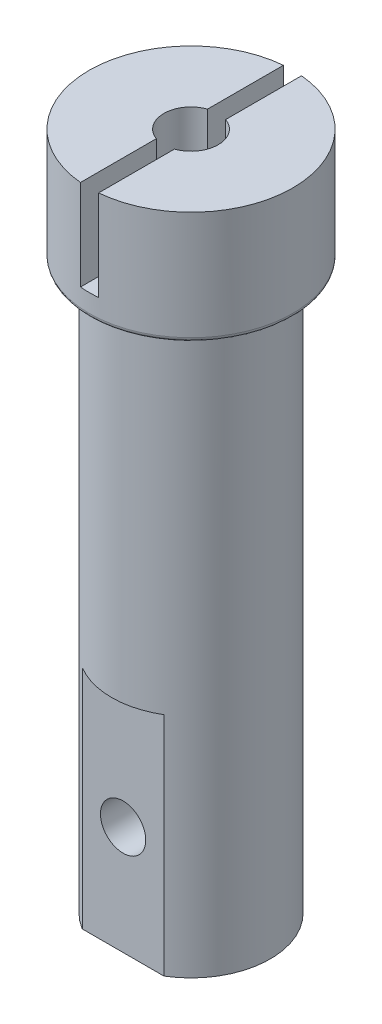
ISO-10303-21;
HEADER;
FILE_DESCRIPTION(('STEP AP214'),'2;1');
FILE_NAME('part.step','',(''),(''),'','','');
FILE_SCHEMA(('AUTOMOTIVE_DESIGN { 1 0 10303 214 1 1 1 1 }'));
ENDSEC;
DATA;
#1=APPLICATION_CONTEXT('core data for automotive mechanical design processes');
#2=APPLICATION_PROTOCOL_DEFINITION('international standard','automotive_design',2000,#1);
#3=PRODUCT_CONTEXT('',#1,'mechanical');
#4=PRODUCT('Part','Part','',(#3));
#5=PRODUCT_RELATED_PRODUCT_CATEGORY('part','',(#4));
#6=PRODUCT_DEFINITION_FORMATION('','',#4);
#7=PRODUCT_DEFINITION_CONTEXT('part definition',#1,'design');
#8=PRODUCT_DEFINITION('design','',#6,#7);
#9=PRODUCT_DEFINITION_SHAPE('','',#8);
#10=(LENGTH_UNIT() NAMED_UNIT(*) SI_UNIT(.MILLI.,.METRE.));
#11=(NAMED_UNIT(*) PLANE_ANGLE_UNIT() SI_UNIT($,.RADIAN.));
#12=(NAMED_UNIT(*) SI_UNIT($,.STERADIAN.) SOLID_ANGLE_UNIT());
#13=UNCERTAINTY_MEASURE_WITH_UNIT(LENGTH_MEASURE(1.E-05),#10,'distance_accuracy_value','');
#14=(GEOMETRIC_REPRESENTATION_CONTEXT(3) GLOBAL_UNCERTAINTY_ASSIGNED_CONTEXT((#13)) GLOBAL_UNIT_ASSIGNED_CONTEXT((#10,
#11,#12)) REPRESENTATION_CONTEXT('',''));
#15=CARTESIAN_POINT('',(0.,0.,0.));
#16=DIRECTION('',(0.,0.,1.));
#17=DIRECTION('',(1.,0.,0.));
#18=AXIS2_PLACEMENT_3D('',#15,#16,#17);
#19=CARTESIAN_POINT('',(0.,-150.,0.));
#20=DIRECTION('',(0.,1.,0.));
#21=DIRECTION('',(0.,0.,1.));
#22=AXIS2_PLACEMENT_3D('',#19,#20,#21);
#23=CYLINDRICAL_SURFACE('',#22,17.5);
#24=CARTESIAN_POINT('',(0.,-25.,0.));
#25=DIRECTION('',(0.,1.,0.));
#26=DIRECTION('',(0.,0.,1.));
#27=AXIS2_PLACEMENT_3D('',#24,#25,#26);
#28=CIRCLE('',#27,17.5);
#29=CARTESIAN_POINT('',(0.,-25.,17.5));
#30=VERTEX_POINT('',#29);
#31=EDGE_CURVE('E133',#30,#30,#28,.T.);
#32=ORIENTED_EDGE('',*,*,#31,.F.);
#33=EDGE_LOOP('',(#32));
#34=FACE_BOUND('',#33,.T.);
#35=CARTESIAN_POINT('',(0.,-100.,0.));
#36=DIRECTION('',(0.,1.,0.));
#37=DIRECTION('',(0.,0.,1.));
#38=AXIS2_PLACEMENT_3D('',#35,#36,#37);
#39=CIRCLE('',#38,17.5);
#40=CARTESIAN_POINT('',(9.01387818865998,-100.,15.));
#41=VERTEX_POINT('',#40);
#42=CARTESIAN_POINT('',(-9.01387818865998,-100.,15.));
#43=VERTEX_POINT('',#42);
#44=EDGE_CURVE('E123',#41,#43,#39,.F.);
#45=ORIENTED_EDGE('',*,*,#44,.F.);
#46=DIRECTION('',(0.,1.,0.));
#47=VECTOR('',#46,1.);
#48=CARTESIAN_POINT('',(9.01387818865998,-150.,15.));
#49=LINE('',#48,#47);
#50=CARTESIAN_POINT('',(9.01387818865998,-150.,15.));
#51=VERTEX_POINT('',#50);
#52=EDGE_CURVE('E118',#41,#51,#49,.F.);
#53=ORIENTED_EDGE('',*,*,#52,.T.);
#54=CARTESIAN_POINT('',(0.,-150.,0.));
#55=DIRECTION('',(0.,1.,0.));
#56=DIRECTION('',(0.,0.,1.));
#57=AXIS2_PLACEMENT_3D('',#54,#55,#56);
#58=CIRCLE('',#57,17.5);
#59=CARTESIAN_POINT('',(-9.01387818865998,-150.,15.));
#60=VERTEX_POINT('',#59);
#61=EDGE_CURVE('E128',#51,#60,#58,.T.);
#62=ORIENTED_EDGE('',*,*,#61,.T.);
#63=DIRECTION('',(0.,1.,0.));
#64=VECTOR('',#63,1.);
#65=CARTESIAN_POINT('',(-9.01387818865998,-150.,15.));
#66=LINE('',#65,#64);
#67=EDGE_CURVE('E54',#60,#43,#66,.T.);
#68=ORIENTED_EDGE('',*,*,#67,.T.);
#69=EDGE_LOOP('',(#45,#53,#62,#68));
#70=FACE_BOUND('',#69,.T.);
#71=ADVANCED_FACE('F39',(#34,#70),#23,.T.);
#72=CARTESIAN_POINT('',(0.,-150.,0.));
#73=DIRECTION('',(0.,1.,0.));
#74=DIRECTION('',(0.,0.,1.));
#75=AXIS2_PLACEMENT_3D('',#72,#73,#74);
#76=PLANE('',#75);
#77=CARTESIAN_POINT('',(0.,-150.,0.));
#78=DIRECTION('',(0.,1.,0.));
#79=DIRECTION('',(0.,0.,1.));
#80=AXIS2_PLACEMENT_3D('',#77,#78,#79);
#81=CIRCLE('',#80,6.);
#82=CARTESIAN_POINT('',(0.,-150.,6.));
#83=VERTEX_POINT('',#82);
#84=EDGE_CURVE('E139',#83,#83,#81,.T.);
#85=ORIENTED_EDGE('',*,*,#84,.T.);
#86=EDGE_LOOP('',(#85));
#87=FACE_BOUND('',#86,.T.);
#88=DIRECTION('',(1.,0.,0.));
#89=VECTOR('',#88,1.);
#90=CARTESIAN_POINT('',(0.,-150.,15.));
#91=LINE('',#90,#89);
#92=EDGE_CURVE('E115',#60,#51,#91,.T.);
#93=ORIENTED_EDGE('',*,*,#92,.F.);
#94=ORIENTED_EDGE('',*,*,#61,.F.);
#95=EDGE_LOOP('',(#93,#94));
#96=FACE_BOUND('',#95,.T.);
#97=ADVANCED_FACE('F131',(#87,#96),#76,.F.);
#98=CARTESIAN_POINT('',(0.,-150.,0.));
#99=DIRECTION('',(0.,1.,0.));
#100=DIRECTION('',(0.,0.,1.));
#101=AXIS2_PLACEMENT_3D('',#98,#99,#100);
#102=CYLINDRICAL_SURFACE('',#101,22.5);
#103=CARTESIAN_POINT('',(0.,-24.,0.));
#104=DIRECTION('',(0.,1.,0.));
#105=DIRECTION('',(0.,0.,1.));
#106=AXIS2_PLACEMENT_3D('',#103,#104,#105);
#107=CIRCLE('',#106,22.5);
#108=CARTESIAN_POINT('',(0.,-24.,22.5));
#109=VERTEX_POINT('',#108);
#110=EDGE_CURVE('E12',#109,#109,#107,.T.);
#111=ORIENTED_EDGE('',*,*,#110,.T.);
#112=EDGE_LOOP('',(#111));
#113=FACE_BOUND('',#112,.T.);
#114=CARTESIAN_POINT('',(0.,0.,0.));
#115=DIRECTION('',(0.,1.,0.));
#116=DIRECTION('',(0.,0.,1.));
#117=AXIS2_PLACEMENT_3D('',#114,#115,#116);
#118=CIRCLE('',#117,22.5);
#119=CARTESIAN_POINT('',(1.99999999999999,0.,22.410934831015));
#120=VERTEX_POINT('',#119);
#121=CARTESIAN_POINT('',(1.99999999999999,0.,-22.410934831015));
#122=VERTEX_POINT('',#121);
#123=EDGE_CURVE('E136',#120,#122,#118,.T.);
#124=ORIENTED_EDGE('',*,*,#123,.F.);
#125=DIRECTION('',(0.,1.,0.));
#126=VECTOR('',#125,1.);
#127=CARTESIAN_POINT('',(2.00000000000006,-150.,22.410934831015));
#128=LINE('',#127,#126);
#129=CARTESIAN_POINT('',(2.,-20.,22.410934831015));
#130=VERTEX_POINT('',#129);
#131=EDGE_CURVE('E205',#120,#130,#128,.F.);
#132=ORIENTED_EDGE('',*,*,#131,.T.);
#133=CARTESIAN_POINT('',(0.,-20.,0.));
#134=DIRECTION('',(0.,1.,0.));
#135=DIRECTION('',(-1.,0.,0.));
#136=AXIS2_PLACEMENT_3D('',#133,#134,#135);
#137=CIRCLE('',#136,22.5);
#138=CARTESIAN_POINT('',(-2.,-20.,22.4109348310149));
#139=VERTEX_POINT('',#138);
#140=EDGE_CURVE('E232',#130,#139,#137,.F.);
#141=ORIENTED_EDGE('',*,*,#140,.T.);
#142=DIRECTION('',(0.,1.,0.));
#143=VECTOR('',#142,1.);
#144=CARTESIAN_POINT('',(-2.00000000000002,-150.,22.410934831015));
#145=LINE('',#144,#143);
#146=CARTESIAN_POINT('',(-1.99999999999999,0.,22.410934831015));
#147=VERTEX_POINT('',#146);
#148=EDGE_CURVE('E230',#147,#139,#145,.F.);
#149=ORIENTED_EDGE('',*,*,#148,.F.);
#150=CARTESIAN_POINT('',(-1.99999999999999,0.,-22.410934831015));
#151=VERTEX_POINT('',#150);
#152=EDGE_CURVE('E132',#151,#147,#118,.T.);
#153=ORIENTED_EDGE('',*,*,#152,.F.);
#154=DIRECTION('',(0.,1.,0.));
#155=VECTOR('',#154,1.);
#156=CARTESIAN_POINT('',(-2.00000000000002,-150.,-22.410934831015));
#157=LINE('',#156,#155);
#158=CARTESIAN_POINT('',(-2.,-20.,-22.410934831015));
#159=VERTEX_POINT('',#158);
#160=EDGE_CURVE('E218',#159,#151,#157,.T.);
#161=ORIENTED_EDGE('',*,*,#160,.F.);
#162=CARTESIAN_POINT('',(2.,-20.,-22.410934831015));
#163=VERTEX_POINT('',#162);
#164=EDGE_CURVE('E233',#159,#163,#137,.F.);
#165=ORIENTED_EDGE('',*,*,#164,.T.);
#166=DIRECTION('',(0.,1.,0.));
#167=VECTOR('',#166,1.);
#168=CARTESIAN_POINT('',(2.00000000000006,-150.,-22.410934831015));
#169=LINE('',#168,#167);
#170=EDGE_CURVE('E207',#163,#122,#169,.T.);
#171=ORIENTED_EDGE('',*,*,#170,.T.);
#172=EDGE_LOOP('',(#124,#132,#141,#149,#153,#161,#165,#171));
#173=FACE_BOUND('',#172,.T.);
#174=ADVANCED_FACE('F179',(#113,#173),#102,.T.);
#175=CARTESIAN_POINT('',(0.,0.,0.));
#176=DIRECTION('',(0.,1.,0.));
#177=DIRECTION('',(0.,0.,1.));
#178=AXIS2_PLACEMENT_3D('',#175,#176,#177);
#179=PLANE('',#178);
#180=ORIENTED_EDGE('',*,*,#123,.T.);
#181=DIRECTION('',(0.,0.,1.));
#182=VECTOR('',#181,1.);
#183=CARTESIAN_POINT('',(1.99999999999999,0.,-22.5));
#184=LINE('',#183,#182);
#185=CARTESIAN_POINT('',(1.99999999999999,0.,-5.65685424949237));
#186=VERTEX_POINT('',#185);
#187=EDGE_CURVE('E211',#122,#186,#184,.T.);
#188=ORIENTED_EDGE('',*,*,#187,.T.);
#189=CARTESIAN_POINT('',(0.,0.,0.));
#190=DIRECTION('',(0.,1.,0.));
#191=DIRECTION('',(0.,0.,1.));
#192=AXIS2_PLACEMENT_3D('',#189,#190,#191);
#193=CIRCLE('',#192,6.);
#194=CARTESIAN_POINT('',(1.99999999999999,0.,5.65685424949235));
#195=VERTEX_POINT('',#194);
#196=EDGE_CURVE('E142',#195,#186,#193,.T.);
#197=ORIENTED_EDGE('',*,*,#196,.F.);
#198=EDGE_CURVE('E213',#195,#120,#184,.T.);
#199=ORIENTED_EDGE('',*,*,#198,.T.);
#200=EDGE_LOOP('',(#180,#188,#197,#199));
#201=FACE_BOUND('',#200,.T.);
#202=ADVANCED_FACE('F193',(#201),#179,.T.);
#203=CARTESIAN_POINT('',(0.,-150.,0.));
#204=DIRECTION('',(0.,1.,0.));
#205=DIRECTION('',(0.,0.,1.));
#206=AXIS2_PLACEMENT_3D('',#203,#204,#205);
#207=CYLINDRICAL_SURFACE('',#206,6.);
#208=CARTESIAN_POINT('',(5.,-126.,3.3166247903554));
#209=CARTESIAN_POINT('',(4.99999873669809,-126.088357331619,3.31662794476976));
#210=CARTESIAN_POINT('',(4.99764949990447,-126.17674313147,3.32017760246919));
#211=CARTESIAN_POINT('',(4.9883232589617,-126.352735942958,3.33417045527444));
#212=CARTESIAN_POINT('',(4.98134326778329,-126.440342414908,3.3446180998479));
#213=CARTESIAN_POINT('',(4.95364903692458,-126.701381115052,3.38563021825916));
#214=CARTESIAN_POINT('',(4.92618156230663,-126.872671192586,3.42586057200479));
#215=CARTESIAN_POINT('',(4.8662676184845,-127.15477857127,3.51015584068141));
#216=CARTESIAN_POINT('',(4.83790385903172,-127.26808765609,3.54929709438413));
#217=CARTESIAN_POINT('',(4.77420588995433,-127.490054140229,3.63452822238789));
#218=CARTESIAN_POINT('',(4.73887096042456,-127.59871105771,3.68061881422353));
#219=CARTESIAN_POINT('',(4.66163300443267,-127.811644554045,3.77796853322909));
#220=CARTESIAN_POINT('',(4.61971110606068,-127.915907420314,3.82924235518147));
#221=CARTESIAN_POINT('',(4.52974410509652,-128.119866277973,3.93525823032699));
#222=CARTESIAN_POINT('',(4.48170041311135,-128.219563314267,3.98999948308479));
#223=CARTESIAN_POINT('',(4.35697668331639,-128.458064552314,4.12658292854896));
#224=CARTESIAN_POINT('',(4.2770750663186,-128.59450175216,4.20963305622119));
#225=CARTESIAN_POINT('',(4.10527119440744,-128.858595640594,4.37734960453415));
#226=CARTESIAN_POINT('',(4.01336378337445,-128.986248520416,4.46201670619973));
#227=CARTESIAN_POINT('',(3.81774867232314,-129.232567906254,4.63048997394916));
#228=CARTESIAN_POINT('',(3.71405188298721,-129.351242554597,4.71429685905415));
#229=CARTESIAN_POINT('',(3.49487447811014,-129.579225014062,4.87900188054923));
#230=CARTESIAN_POINT('',(3.37939835739527,-129.688536369009,4.95990111064141));
#231=CARTESIAN_POINT('',(3.06673100282963,-129.95710777221,5.16206895424224));
#232=CARTESIAN_POINT('',(2.86071294008214,-130.108976821495,5.27982320972114));
#233=CARTESIAN_POINT('',(2.42053048533952,-130.382693706399,5.49554073761411));
#234=CARTESIAN_POINT('',(2.18641261186312,-130.504590168,5.59353601884901));
#235=CARTESIAN_POINT('',(1.73582524378119,-130.69422711566,5.74745712484946));
#236=CARTESIAN_POINT('',(1.52329920748387,-130.76768639697,5.8077267361435));
#237=CARTESIAN_POINT('',(1.19502628232576,-130.856420576205,5.88086312369275));
#238=CARTESIAN_POINT('',(1.08398885378292,-130.882427127586,5.90236752178029));
#239=CARTESIAN_POINT('',(0.859429029159051,-130.926911634562,5.93921712526113));
#240=CARTESIAN_POINT('',(0.745907665517399,-130.945392657753,5.9545648402373));
#241=CARTESIAN_POINT('',(0.516669986290185,-130.9745820386,5.97882939527611));
#242=CARTESIAN_POINT('',(0.400946149218977,-130.985255428814,5.98771730317482));
#243=CARTESIAN_POINT('',(0.16871150725425,-130.998505894175,5.99875382699588));
#244=CARTESIAN_POINT('',(0.0522007007505019,-131.001082952753,6.00090242912464));
#245=CARTESIAN_POINT('',(-0.18064061272065,-130.998092172682,5.99841018407049));
#246=CARTESIAN_POINT('',(-0.296971122369209,-130.99252445634,5.99376943883931));
#247=CARTESIAN_POINT('',(-0.528497640320109,-130.973347373147,5.97780528304919));
#248=CARTESIAN_POINT('',(-0.643693687235151,-130.959738280963,5.96648210073921));
#249=CARTESIAN_POINT('',(-0.864356619363613,-130.925900046649,5.93838432928764));
#250=CARTESIAN_POINT('',(-0.969955578180822,-130.906179448638,5.9220290408177));
#251=CARTESIAN_POINT('',(-1.17877369259591,-130.860240700624,5.88402713952791));
#252=CARTESIAN_POINT('',(-1.28199203813954,-130.834020373589,5.86237875386122));
#253=CARTESIAN_POINT('',(-1.58714445298208,-130.746123542295,5.79004001335747));
#254=CARTESIAN_POINT('',(-1.78475392929083,-130.675183145112,5.73193253821423));
#255=CARTESIAN_POINT('',(-2.18109489736999,-130.504815449882,5.59380617850915));
#256=CARTESIAN_POINT('',(-2.37847529507848,-130.403469887338,5.51233775066246));
#257=CARTESIAN_POINT('',(-2.75357057398258,-130.179193176341,5.33487872344962));
#258=CARTESIAN_POINT('',(-2.93126754359994,-130.056242626577,5.2388750822546));
#259=CARTESIAN_POINT('',(-3.22215723430857,-129.826552681739,5.0634525636271));
#260=CARTESIAN_POINT('',(-3.34006525019966,-129.723983814922,4.98626319074505));
#261=CARTESIAN_POINT('',(-3.56460009114,-129.509659563431,4.82829724388017));
#262=CARTESIAN_POINT('',(-3.67122655299483,-129.397903883204,4.7475205545273));
#263=CARTESIAN_POINT('',(-3.87335486662883,-129.165577762687,4.58410798881025));
#264=CARTESIAN_POINT('',(-3.96883598706688,-129.044991553801,4.5014689784442));
#265=CARTESIAN_POINT('',(-4.148392580472,-128.79543654578,4.33655118512332));
#266=CARTESIAN_POINT('',(-4.23247215435344,-128.666470785426,4.25427228300422));
#267=CARTESIAN_POINT('',(-4.36822595130953,-128.435458883206,4.1140537410506));
#268=CARTESIAN_POINT('',(-4.42257235849338,-128.335372164501,4.05545922530511));
#269=CARTESIAN_POINT('',(-4.52484320866561,-128.130470943921,3.94102466938531));
#270=CARTESIAN_POINT('',(-4.57276924083878,-128.025657620601,3.88518394975591));
#271=CARTESIAN_POINT('',(-4.66182216521771,-127.811310149254,3.77786515537514));
#272=CARTESIAN_POINT('',(-4.7029636149486,-127.701786761803,3.72637785846063));
#273=CARTESIAN_POINT('',(-4.77809629923188,-127.477757684949,3.62953832593278));
#274=CARTESIAN_POINT('',(-4.81209095358585,-127.363254410268,3.58418315976846));
#275=CARTESIAN_POINT('',(-4.88281523848206,-127.088380736585,3.48752939102618));
#276=CARTESIAN_POINT('',(-4.91639072302862,-126.925897664081,3.43964173138411));
#277=CARTESIAN_POINT('',(-4.95467936927281,-126.67691440476,3.3840294682241));
#278=CARTESIAN_POINT('',(-4.96542704017028,-126.593094427593,3.36819980713384));
#279=CARTESIAN_POINT('',(-4.98270218202997,-126.424119901189,3.34259187408393));
#280=CARTESIAN_POINT('',(-4.9892317226928,-126.338966027492,3.33281063445973));
#281=CARTESIAN_POINT('',(-4.99794561301056,-126.167284205897,3.31972939847515));
#282=CARTESIAN_POINT('',(-5.00009664387433,-126.080750735018,3.31647910249414));
#283=CARTESIAN_POINT('',(-4.99989668987805,-125.907702623172,3.31678052916364));
#284=CARTESIAN_POINT('',(-4.99754581074186,-125.82118798181,3.32033209207776));
#285=CARTESIAN_POINT('',(-4.98840108067787,-125.648845329324,3.33405478268835));
#286=CARTESIAN_POINT('',(-4.98160291080297,-125.563018067842,3.34423234511941));
#287=CARTESIAN_POINT('',(-4.96372506243882,-125.392735068692,3.37071006080504));
#288=CARTESIAN_POINT('',(-4.95264297878863,-125.308280129305,3.38701365331436));
#289=CARTESIAN_POINT('',(-4.92312920097743,-125.120231607996,3.4298153168895));
#290=CARTESIAN_POINT('',(-4.90354996537011,-125.017167689583,3.45784615150597));
#291=CARTESIAN_POINT('',(-4.85852481786917,-124.814446746996,3.52082821574177));
#292=CARTESIAN_POINT('',(-4.83307391160852,-124.714792706558,3.55578533317367));
#293=CARTESIAN_POINT('',(-4.77668497524489,-124.518885870487,3.63118441347011));
#294=CARTESIAN_POINT('',(-4.74573267813378,-124.422642718162,3.67164057148065));
#295=CARTESIAN_POINT('',(-4.67875547309405,-124.233852669996,3.75661784436829));
#296=CARTESIAN_POINT('',(-4.64273195913627,-124.141304767354,3.80113784100324));
#297=CARTESIAN_POINT('',(-4.54397265387657,-123.908046953392,3.91932882912655));
#298=CARTESIAN_POINT('',(-4.47770636941174,-123.769919398337,3.99516418797816));
#299=CARTESIAN_POINT('',(-4.33391164170768,-123.501932122123,4.15071747665811));
#300=CARTESIAN_POINT('',(-4.25637738328211,-123.37207672014,4.23043739702733));
#301=CARTESIAN_POINT('',(-4.09024004761832,-123.120294254834,4.39127806383232));
#302=CARTESIAN_POINT('',(-4.00162403459393,-122.998376714554,4.47240035029546));
#303=CARTESIAN_POINT('',(-3.81350438629221,-122.762731735844,4.63384848035874));
#304=CARTESIAN_POINT('',(-3.71400285158986,-122.649002724275,4.71417447436781));
#305=CARTESIAN_POINT('',(-3.50140550373491,-122.427277378878,4.87425051167102));
#306=CARTESIAN_POINT('',(-3.38802651923024,-122.319502834655,4.95393296540463));
#307=CARTESIAN_POINT('',(-3.14979793373926,-122.113671449091,5.1087133775938));
#308=CARTESIAN_POINT('',(-3.02494622324837,-122.015616401804,5.18381048869445));
#309=CARTESIAN_POINT('',(-2.764328189954,-121.830592947242,5.32734082462688));
#310=CARTESIAN_POINT('',(-2.62859396116214,-121.743593763711,5.3957924172145));
#311=CARTESIAN_POINT('',(-2.34638028849604,-121.581751703963,5.5243555329434));
#312=CARTESIAN_POINT('',(-2.19990728004653,-121.50690163221,5.58447198962527));
#313=CARTESIAN_POINT('',(-1.94745044116189,-121.393512899591,5.67617962065397));
#314=CARTESIAN_POINT('',(-1.84418602584171,-121.351173133296,5.71061150195718));
#315=CARTESIAN_POINT('',(-1.63367247394078,-121.273086882035,5.7743569464432));
#316=CARTESIAN_POINT('',(-1.52642443467036,-121.237338597356,5.80367190661347));
#317=CARTESIAN_POINT('',(-1.30849019874855,-121.17291380295,5.85665652035684));
#318=CARTESIAN_POINT('',(-1.19780495114673,-121.144235360373,5.88032771684107));
#319=CARTESIAN_POINT('',(-0.973686630751911,-121.094380295454,5.9215629924842));
#320=CARTESIAN_POINT('',(-0.860254836759016,-121.07320025096,5.93912985749713));
#321=CARTESIAN_POINT('',(-0.630783080696328,-121.038584222936,5.96787674727981));
#322=CARTESIAN_POINT('',(-0.514732461396096,-121.025189992737,5.9790223335991));
#323=CARTESIAN_POINT('',(-0.2815706705456,-121.006565361142,5.99452773833021));
#324=CARTESIAN_POINT('',(-0.16445994202682,-121.001331694644,5.99889027069058));
#325=CARTESIAN_POINT('',(0.0699121411590942,-120.999115279661,6.00073725326668));
#326=CARTESIAN_POINT('',(0.187173516250292,-121.002133802304,5.99822064385191));
#327=CARTESIAN_POINT('',(0.420843634561662,-121.016367555496,5.98636592157635));
#328=CARTESIAN_POINT('',(0.537252412362324,-121.027582451727,5.97702808694248));
#329=CARTESIAN_POINT('',(0.759836291993657,-121.056892667466,5.95266735271362));
#330=CARTESIAN_POINT('',(0.866137262021012,-121.07442488611,5.93811010610555));
#331=CARTESIAN_POINT('',(1.07655589912372,-121.116092798666,5.90359345775072));
#332=CARTESIAN_POINT('',(1.18067285873546,-121.140230597808,5.88363233378418));
#333=CARTESIAN_POINT('',(1.48877367881919,-121.222070719172,5.8161531152621));
#334=CARTESIAN_POINT('',(1.68868566836387,-121.289223927613,5.76101886378343));
#335=CARTESIAN_POINT('',(2.08770893335355,-121.451235770944,5.62928736591243));
#336=CARTESIAN_POINT('',(2.2857113948251,-121.547750060002,5.5514238631896));
#337=CARTESIAN_POINT('',(2.66271401761212,-121.762423360407,5.3807802129057));
#338=CARTESIAN_POINT('',(2.84169935856704,-121.880599060226,5.28798857113477));
#339=CARTESIAN_POINT('',(3.13537854219957,-122.102071147993,5.11764052278966));
#340=CARTESIAN_POINT('',(3.2546568396948,-122.201196026972,5.04243215748702));
#341=CARTESIAN_POINT('',(3.48218762121501,-122.408612723105,4.8880726992661));
#342=CARTESIAN_POINT('',(3.59043986998793,-122.51690473576,4.80892152227751));
#343=CARTESIAN_POINT('',(3.79610354841709,-122.74225136513,4.64829669559417));
#344=CARTESIAN_POINT('',(3.89349136454405,-122.859324177985,4.56681845260895));
#345=CARTESIAN_POINT('',(4.07712890054715,-123.101701356768,4.40364489159083));
#346=CARTESIAN_POINT('',(4.16338204818516,-123.227003171425,4.32194964830245));
#347=CARTESIAN_POINT('',(4.30711013423569,-123.457748618697,4.17813106947149));
#348=CARTESIAN_POINT('',(4.36676620571685,-123.561592522764,4.11561154336168));
#349=CARTESIAN_POINT('',(4.47903059796968,-123.774516514727,3.99314168453416));
#350=CARTESIAN_POINT('',(4.53163812248682,-123.883597192319,3.93319164260324));
#351=CARTESIAN_POINT('',(4.62939117572736,-124.106971138512,3.81764974603365));
#352=CARTESIAN_POINT('',(4.67455270718899,-124.221252536595,3.76204868361037));
#353=CARTESIAN_POINT('',(4.75703840843709,-124.455332200692,3.65718908304624));
#354=CARTESIAN_POINT('',(4.79436712192208,-124.575127218884,3.6079268742837));
#355=CARTESIAN_POINT('',(4.87112383115559,-124.85974301565,3.50393713411262));
#356=CARTESIAN_POINT('',(4.90740860229219,-125.026715860445,3.45249622153167));
#357=CARTESIAN_POINT('',(4.94906155040725,-125.282873939422,3.39225340367089));
#358=CARTESIAN_POINT('',(4.96080991746183,-125.369095607749,3.37500354661876));
#359=CARTESIAN_POINT('',(4.97984154687568,-125.54304020515,3.34685992066568));
#360=CARTESIAN_POINT('',(4.98712785716359,-125.63076206728,3.33596181327638));
#361=CARTESIAN_POINT('',(4.99472098046215,-125.765576628857,3.32457244302594));
#362=CARTESIAN_POINT('',(4.99669862748169,-125.812382029319,3.32159733493985));
#363=CARTESIAN_POINT('',(4.9993385955846,-125.906122259661,3.3176224863153));
#364=CARTESIAN_POINT('',(5.00000067117283,-125.953057112062,3.31662311446369));
#365=CARTESIAN_POINT('',(5.,-126.,3.3166247903554));
#366=B_SPLINE_CURVE_WITH_KNOTS('',3,(#208,#209,#210,#211,#212,#213,#214,#215,#216,#217,#218,
#219,#220,#221,#222,#223,#224,#225,#226,#227,#228,#229,#230,#231,#232,#233,#234,#235,#236,#237,
#238,#239,#240,#241,#242,#243,#244,#245,#246,#247,#248,#249,#250,#251,#252,#253,#254,#255,#256,
#257,#258,#259,#260,#261,#262,#263,#264,#265,#266,#267,#268,#269,#270,#271,#272,#273,#274,#275,
#276,#277,#278,#279,#280,#281,#282,#283,#284,#285,#286,#287,#288,#289,#290,#291,#292,#293,#294,
#295,#296,#297,#298,#299,#300,#301,#302,#303,#304,#305,#306,#307,#308,#309,#310,#311,#312,#313,
#314,#315,#316,#317,#318,#319,#320,#321,#322,#323,#324,#325,#326,#327,#328,#329,#330,#331,#332,
#333,#334,#335,#336,#337,#338,#339,#340,#341,#342,#343,#344,#345,#346,#347,#348,#349,#350,#351,
#352,#353,#354,#355,#356,#357,#358,#359,#360,#361,#362,#363,#364,#365),.UNSPECIFIED.,.T.,.F.,(4,
2,2,2,2,2,2,2,2,2,2,2,2,2,2,2,2,2,2,2,2,2,2,2,2,2,2,2,2,2,2,2,2,2,2,2,2,2,2,2,2,2,2,2,2,2,2,2,2,
2,2,2,2,2,2,2,2,2,2,2,2,2,2,2,2,2,2,2,2,2,2,2,2,2,2,2,2,2,4),(0.,0.26501395281901,
0.530199017087559,1.06163719911787,1.43076789442493,1.79993672943003,2.17018320936789,
2.5403445294581,3.07543019863956,3.61074643087444,4.1455712175599,4.68019268072499,
5.52201270319166,6.36245785313039,7.05764252128533,7.40543000351039,7.7530755764404,
8.10226874637169,8.45146263100877,8.80065127205552,9.14982798671479,9.47544830739572,
9.80117783968313,10.452097720823,11.1587200789087,11.8659802583275,12.3882608741328,
12.9105582989455,13.433812263902,13.9568775225451,14.3408709272065,14.7247691086984,
15.1078325378949,15.4907122487077,16.0066331878932,16.2642904978429,16.5218212874357,
16.7813045706503,17.0407817601757,17.3005113135067,17.5603869017105,17.88563307949,
18.2111569341447,18.5375376410063,18.8638288072221,19.3759116451389,19.8882597039457,
20.4012115116444,20.914064509245,21.440068707524,21.966169817129,22.490772748683,
23.0150638316063,23.3651335641895,23.7151075730877,24.064985794924,24.4147041313183,
24.7662810155412,25.117717195098,25.4692075112738,25.8206834915196,26.1464577543447,
26.4723359641475,27.123555693192,27.8219883018055,28.5209612788416,29.037431210159,
29.5539121585847,30.0714946488293,30.5889174215279,30.9939304204944,31.3989891341329,
31.8031656262596,32.2071070096085,32.7401711696445,33.0060225378416,33.2716921059159,
33.4124636663662,33.5532614933412),.UNSPECIFIED.);
#367=CARTESIAN_POINT('',(5.,-126.,3.3166247903554));
#368=VERTEX_POINT('',#367);
#369=EDGE_CURVE('E378',#368,#368,#366,.T.);
#370=ORIENTED_EDGE('',*,*,#369,.F.);
#371=EDGE_LOOP('',(#370));
#372=FACE_BOUND('',#371,.T.);
#373=ORIENTED_EDGE('',*,*,#84,.F.);
#374=EDGE_LOOP('',(#373));
#375=FACE_BOUND('',#374,.T.);
#376=DIRECTION('',(0.,1.,0.));
#377=VECTOR('',#376,1.);
#378=CARTESIAN_POINT('',(2.00000000000006,-150.,5.65685424949236));
#379=LINE('',#378,#377);
#380=CARTESIAN_POINT('',(2.,-20.,5.65685424949238));
#381=VERTEX_POINT('',#380);
#382=EDGE_CURVE('E124',#195,#381,#379,.F.);
#383=ORIENTED_EDGE('',*,*,#382,.F.);
#384=ORIENTED_EDGE('',*,*,#196,.T.);
#385=DIRECTION('',(0.,1.,0.));
#386=VECTOR('',#385,1.);
#387=CARTESIAN_POINT('',(2.00000000000006,-150.,-5.65685424949236));
#388=LINE('',#387,#386);
#389=CARTESIAN_POINT('',(2.,-20.,-5.65685424949238));
#390=VERTEX_POINT('',#389);
#391=EDGE_CURVE('E150',#390,#186,#388,.T.);
#392=ORIENTED_EDGE('',*,*,#391,.F.);
#393=CARTESIAN_POINT('',(0.,-20.,0.));
#394=DIRECTION('',(0.,1.,0.));
#395=DIRECTION('',(-1.,0.,0.));
#396=AXIS2_PLACEMENT_3D('',#393,#394,#395);
#397=CIRCLE('',#396,6.);
#398=CARTESIAN_POINT('',(-2.,-20.,-5.65685424949238));
#399=VERTEX_POINT('',#398);
#400=EDGE_CURVE('E148',#399,#390,#397,.F.);
#401=ORIENTED_EDGE('',*,*,#400,.F.);
#402=DIRECTION('',(0.,1.,0.));
#403=VECTOR('',#402,1.);
#404=CARTESIAN_POINT('',(-2.00000000000002,-150.,-5.65685424949237));
#405=LINE('',#404,#403);
#406=CARTESIAN_POINT('',(-2.00000000000002,0.,-5.65685424949237));
#407=VERTEX_POINT('',#406);
#408=EDGE_CURVE('E145',#399,#407,#405,.T.);
#409=ORIENTED_EDGE('',*,*,#408,.T.);
#410=CARTESIAN_POINT('',(-1.99999999999999,0.,5.65685424949237));
#411=VERTEX_POINT('',#410);
#412=EDGE_CURVE('E236',#407,#411,#193,.T.);
#413=ORIENTED_EDGE('',*,*,#412,.T.);
#414=DIRECTION('',(0.,1.,0.));
#415=VECTOR('',#414,1.);
#416=CARTESIAN_POINT('',(-2.00000000000002,-150.,5.65685424949237));
#417=LINE('',#416,#415);
#418=CARTESIAN_POINT('',(-2.00000000000002,-20.,5.65685424949237));
#419=VERTEX_POINT('',#418);
#420=EDGE_CURVE('E153',#411,#419,#417,.F.);
#421=ORIENTED_EDGE('',*,*,#420,.T.);
#422=EDGE_CURVE('E151',#381,#419,#397,.F.);
#423=ORIENTED_EDGE('',*,*,#422,.F.);
#424=EDGE_LOOP('',(#383,#384,#392,#401,#409,#413,#421,#423));
#425=FACE_BOUND('',#424,.T.);
#426=ADVANCED_FACE('F185',(#372,#375,#425),#207,.F.);
#427=DIRECTION('',(0.,0.,1.));
#428=VECTOR('',#427,1.);
#429=CARTESIAN_POINT('',(-1.99999999999999,0.,-22.5));
#430=LINE('',#429,#428);
#431=EDGE_CURVE('E227',#151,#407,#430,.T.);
#432=ORIENTED_EDGE('',*,*,#431,.F.);
#433=ORIENTED_EDGE('',*,*,#152,.T.);
#434=EDGE_CURVE('E129',#411,#147,#430,.T.);
#435=ORIENTED_EDGE('',*,*,#434,.F.);
#436=ORIENTED_EDGE('',*,*,#412,.F.);
#437=EDGE_LOOP('',(#432,#433,#435,#436));
#438=FACE_BOUND('',#437,.T.);
#439=ADVANCED_FACE('F189',(#438),#179,.T.);
#440=CARTESIAN_POINT('',(0.,-25.,0.));
#441=DIRECTION('',(0.,1.,0.));
#442=DIRECTION('',(0.,0.,1.));
#443=AXIS2_PLACEMENT_3D('',#440,#441,#442);
#444=PLANE('',#443);
#445=CARTESIAN_POINT('',(0.,-25.,0.));
#446=DIRECTION('',(0.,1.,0.));
#447=DIRECTION('',(0.,0.,1.));
#448=AXIS2_PLACEMENT_3D('',#445,#446,#447);
#449=CIRCLE('',#448,21.5);
#450=CARTESIAN_POINT('',(0.,-25.,21.5));
#451=VERTEX_POINT('',#450);
#452=EDGE_CURVE('E47',#451,#451,#449,.F.);
#453=ORIENTED_EDGE('',*,*,#452,.T.);
#454=EDGE_LOOP('',(#453));
#455=FACE_BOUND('',#454,.T.);
#456=ORIENTED_EDGE('',*,*,#31,.T.);
#457=EDGE_LOOP('',(#456));
#458=FACE_BOUND('',#457,.T.);
#459=ADVANCED_FACE('F160',(#455,#458),#444,.F.);
#460=CARTESIAN_POINT('',(-1.99999999999999,0.,-22.5));
#461=DIRECTION('',(-1.,0.,0.));
#462=DIRECTION('',(0.,-1.,0.));
#463=AXIS2_PLACEMENT_3D('',#460,#461,#462);
#464=PLANE('',#463);
#465=ORIENTED_EDGE('',*,*,#160,.T.);
#466=ORIENTED_EDGE('',*,*,#431,.T.);
#467=ORIENTED_EDGE('',*,*,#408,.F.);
#468=DIRECTION('',(0.,0.,1.));
#469=VECTOR('',#468,1.);
#470=CARTESIAN_POINT('',(-2.,-20.,-22.5));
#471=LINE('',#470,#469);
#472=EDGE_CURVE('E225',#159,#399,#471,.T.);
#473=ORIENTED_EDGE('',*,*,#472,.F.);
#474=EDGE_LOOP('',(#465,#466,#467,#473));
#475=FACE_BOUND('',#474,.T.);
#476=ADVANCED_FACE('F188',(#475),#464,.F.);
#477=CARTESIAN_POINT('',(2.,-20.,-22.5));
#478=DIRECTION('',(0.,1.,0.));
#479=DIRECTION('',(-1.,0.,0.));
#480=AXIS2_PLACEMENT_3D('',#477,#478,#479);
#481=PLANE('',#480);
#482=ORIENTED_EDGE('',*,*,#472,.T.);
#483=ORIENTED_EDGE('',*,*,#400,.T.);
#484=DIRECTION('',(0.,0.,1.));
#485=VECTOR('',#484,1.);
#486=CARTESIAN_POINT('',(2.,-20.,-22.5));
#487=LINE('',#486,#485);
#488=EDGE_CURVE('E216',#163,#390,#487,.T.);
#489=ORIENTED_EDGE('',*,*,#488,.F.);
#490=ORIENTED_EDGE('',*,*,#164,.F.);
#491=EDGE_LOOP('',(#482,#483,#489,#490));
#492=FACE_BOUND('',#491,.T.);
#493=ADVANCED_FACE('F263',(#492),#481,.T.);
#494=CARTESIAN_POINT('',(1.99999999999999,0.,-22.5));
#495=DIRECTION('',(-1.,0.,0.));
#496=DIRECTION('',(0.,-1.,0.));
#497=AXIS2_PLACEMENT_3D('',#494,#495,#496);
#498=PLANE('',#497);
#499=ORIENTED_EDGE('',*,*,#488,.T.);
#500=ORIENTED_EDGE('',*,*,#391,.T.);
#501=ORIENTED_EDGE('',*,*,#187,.F.);
#502=ORIENTED_EDGE('',*,*,#170,.F.);
#503=EDGE_LOOP('',(#499,#500,#501,#502));
#504=FACE_BOUND('',#503,.T.);
#505=ADVANCED_FACE('F256',(#504),#498,.T.);
#506=ORIENTED_EDGE('',*,*,#198,.F.);
#507=ORIENTED_EDGE('',*,*,#382,.T.);
#508=EDGE_CURVE('E220',#381,#130,#487,.T.);
#509=ORIENTED_EDGE('',*,*,#508,.T.);
#510=ORIENTED_EDGE('',*,*,#131,.F.);
#511=EDGE_LOOP('',(#506,#507,#509,#510));
#512=FACE_BOUND('',#511,.T.);
#513=ADVANCED_FACE('F254',(#512),#498,.T.);
#514=ORIENTED_EDGE('',*,*,#508,.F.);
#515=ORIENTED_EDGE('',*,*,#422,.T.);
#516=EDGE_CURVE('E62',#419,#139,#471,.T.);
#517=ORIENTED_EDGE('',*,*,#516,.T.);
#518=ORIENTED_EDGE('',*,*,#140,.F.);
#519=EDGE_LOOP('',(#514,#515,#517,#518));
#520=FACE_BOUND('',#519,.T.);
#521=ADVANCED_FACE('F253',(#520),#481,.T.);
#522=ORIENTED_EDGE('',*,*,#148,.T.);
#523=ORIENTED_EDGE('',*,*,#516,.F.);
#524=ORIENTED_EDGE('',*,*,#420,.F.);
#525=ORIENTED_EDGE('',*,*,#434,.T.);
#526=EDGE_LOOP('',(#522,#523,#524,#525));
#527=FACE_BOUND('',#526,.T.);
#528=ADVANCED_FACE('F249',(#527),#464,.F.);
#529=CARTESIAN_POINT('',(0.,-100.,15.));
#530=DIRECTION('',(0.,0.,1.));
#531=DIRECTION('',(1.,0.,0.));
#532=AXIS2_PLACEMENT_3D('',#529,#530,#531);
#533=PLANE('',#532);
#534=CARTESIAN_POINT('',(0.,-126.,15.));
#535=DIRECTION('',(0.,0.,1.));
#536=DIRECTION('',(1.,0.,0.));
#537=AXIS2_PLACEMENT_3D('',#534,#535,#536);
#538=CIRCLE('',#537,5.);
#539=CARTESIAN_POINT('',(5.,-126.,15.));
#540=VERTEX_POINT('',#539);
#541=EDGE_CURVE('E380',#540,#540,#538,.T.);
#542=ORIENTED_EDGE('',*,*,#541,.F.);
#543=EDGE_LOOP('',(#542));
#544=FACE_BOUND('',#543,.T.);
#545=DIRECTION('',(-1.,0.,0.));
#546=VECTOR('',#545,1.);
#547=CARTESIAN_POINT('',(0.,-100.,15.));
#548=LINE('',#547,#546);
#549=EDGE_CURVE('E379',#41,#43,#548,.T.);
#550=ORIENTED_EDGE('',*,*,#549,.T.);
#551=ORIENTED_EDGE('',*,*,#67,.F.);
#552=ORIENTED_EDGE('',*,*,#92,.T.);
#553=ORIENTED_EDGE('',*,*,#52,.F.);
#554=EDGE_LOOP('',(#550,#551,#552,#553));
#555=FACE_BOUND('',#554,.T.);
#556=ADVANCED_FACE('F117',(#544,#555),#533,.T.);
#557=CARTESIAN_POINT('',(0.,-100.,0.));
#558=DIRECTION('',(0.,1.,0.));
#559=DIRECTION('',(0.,0.,1.));
#560=AXIS2_PLACEMENT_3D('',#557,#558,#559);
#561=PLANE('',#560);
#562=ORIENTED_EDGE('',*,*,#44,.T.);
#563=ORIENTED_EDGE('',*,*,#549,.F.);
#564=EDGE_LOOP('',(#562,#563));
#565=FACE_BOUND('',#564,.T.);
#566=ADVANCED_FACE('F169',(#565),#561,.F.);
#567=CARTESIAN_POINT('',(0.,-126.,-22.501));
#568=DIRECTION('',(0.,0.,1.));
#569=DIRECTION('',(1.,0.,0.));
#570=AXIS2_PLACEMENT_3D('',#567,#568,#569);
#571=CYLINDRICAL_SURFACE('',#570,5.);
#572=ORIENTED_EDGE('',*,*,#369,.T.);
#573=EDGE_LOOP('',(#572));
#574=FACE_BOUND('',#573,.T.);
#575=ORIENTED_EDGE('',*,*,#541,.T.);
#576=EDGE_LOOP('',(#575));
#577=FACE_BOUND('',#576,.T.);
#578=ADVANCED_FACE('F164',(#574,#577),#571,.F.);
#579=CARTESIAN_POINT('',(0.,-24.,0.));
#580=DIRECTION('',(0.,1.,0.));
#581=DIRECTION('',(0.,0.,1.));
#582=AXIS2_PLACEMENT_3D('',#579,#580,#581);
#583=TOROIDAL_SURFACE('',#582,21.5,1.);
#584=ORIENTED_EDGE('',*,*,#110,.F.);
#585=EDGE_LOOP('',(#584));
#586=FACE_BOUND('',#585,.T.);
#587=ORIENTED_EDGE('',*,*,#452,.F.);
#588=EDGE_LOOP('',(#587));
#589=FACE_BOUND('',#588,.T.);
#590=ADVANCED_FACE('F41',(#586,#589),#583,.T.);
#591=CLOSED_SHELL('',(#71,#97,#174,#202,#426,#439,#459,#476,#493,#505,#513,#521,#528,#556,#566,
#578,#590));
#592=MANIFOLD_SOLID_BREP('B2',#591);
#593=ADVANCED_BREP_SHAPE_REPRESENTATION('',(#18,#592),#14);
#594=SHAPE_DEFINITION_REPRESENTATION(#9,#593);
ENDSEC;
END-ISO-10303-21;
